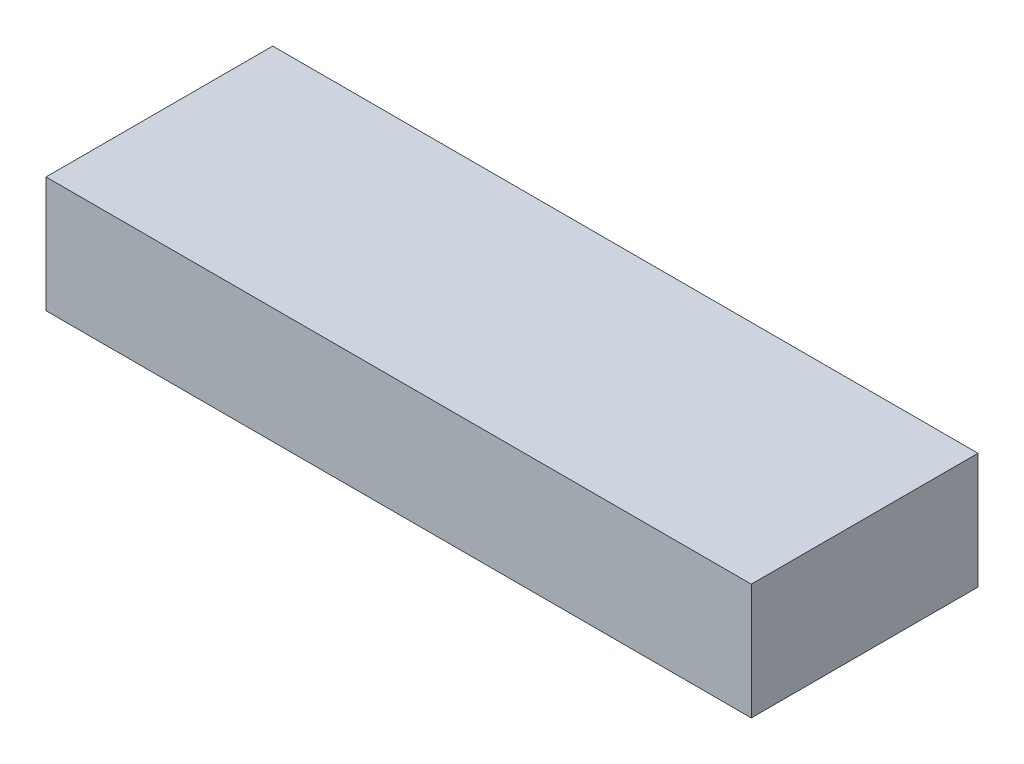
ISO-10303-21;
HEADER;
FILE_DESCRIPTION(('STEP AP214'),'2;1');
FILE_NAME('part.step','',(''),(''),'','','');
FILE_SCHEMA(('AUTOMOTIVE_DESIGN { 1 0 10303 214 1 1 1 1 }'));
ENDSEC;
DATA;
#1=APPLICATION_CONTEXT('core data for automotive mechanical design processes');
#2=APPLICATION_PROTOCOL_DEFINITION('international standard','automotive_design',2000,#1);
#3=PRODUCT_CONTEXT('',#1,'mechanical');
#4=PRODUCT('Part','Part','',(#3));
#5=PRODUCT_RELATED_PRODUCT_CATEGORY('part','',(#4));
#6=PRODUCT_DEFINITION_FORMATION('','',#4);
#7=PRODUCT_DEFINITION_CONTEXT('part definition',#1,'design');
#8=PRODUCT_DEFINITION('design','',#6,#7);
#9=PRODUCT_DEFINITION_SHAPE('','',#8);
#10=(LENGTH_UNIT() NAMED_UNIT(*) SI_UNIT(.MILLI.,.METRE.));
#11=(NAMED_UNIT(*) PLANE_ANGLE_UNIT() SI_UNIT($,.RADIAN.));
#12=(NAMED_UNIT(*) SI_UNIT($,.STERADIAN.) SOLID_ANGLE_UNIT());
#13=UNCERTAINTY_MEASURE_WITH_UNIT(LENGTH_MEASURE(1.E-05),#10,'distance_accuracy_value','');
#14=(GEOMETRIC_REPRESENTATION_CONTEXT(3) GLOBAL_UNCERTAINTY_ASSIGNED_CONTEXT((#13)) GLOBAL_UNIT_ASSIGNED_CONTEXT((#10,
#11,#12)) REPRESENTATION_CONTEXT('',''));
#15=CARTESIAN_POINT('',(0.,0.,0.));
#16=DIRECTION('',(0.,0.,1.));
#17=DIRECTION('',(1.,0.,0.));
#18=AXIS2_PLACEMENT_3D('',#15,#16,#17);
#19=CARTESIAN_POINT('',(-70.,23.,-22.5));
#20=DIRECTION('',(1.,0.,0.));
#21=DIRECTION('',(0.,0.,-1.));
#22=AXIS2_PLACEMENT_3D('',#19,#20,#21);
#23=PLANE('',#22);
#24=DIRECTION('',(0.,0.,1.));
#25=VECTOR('',#24,1.);
#26=CARTESIAN_POINT('',(-70.,0.,-22.5));
#27=LINE('',#26,#25);
#28=CARTESIAN_POINT('',(-70.,0.,-22.5));
#29=VERTEX_POINT('',#28);
#30=CARTESIAN_POINT('',(-70.,0.,22.5));
#31=VERTEX_POINT('',#30);
#32=EDGE_CURVE('E111',#29,#31,#27,.T.);
#33=ORIENTED_EDGE('',*,*,#32,.T.);
#34=DIRECTION('',(0.,-1.,0.));
#35=VECTOR('',#34,1.);
#36=CARTESIAN_POINT('',(-70.,23.,22.5));
#37=LINE('',#36,#35);
#38=CARTESIAN_POINT('',(-70.,23.,22.5));
#39=VERTEX_POINT('',#38);
#40=EDGE_CURVE('E11',#39,#31,#37,.T.);
#41=ORIENTED_EDGE('',*,*,#40,.F.);
#42=DIRECTION('',(0.,0.,1.));
#43=VECTOR('',#42,1.);
#44=CARTESIAN_POINT('',(-70.,23.,-22.5));
#45=LINE('',#44,#43);
#46=CARTESIAN_POINT('',(-70.,23.,-22.5));
#47=VERTEX_POINT('',#46);
#48=EDGE_CURVE('E95',#47,#39,#45,.T.);
#49=ORIENTED_EDGE('',*,*,#48,.F.);
#50=DIRECTION('',(0.,-1.,0.));
#51=VECTOR('',#50,1.);
#52=CARTESIAN_POINT('',(-70.,23.,-22.5));
#53=LINE('',#52,#51);
#54=EDGE_CURVE('E107',#47,#29,#53,.T.);
#55=ORIENTED_EDGE('',*,*,#54,.T.);
#56=EDGE_LOOP('',(#33,#41,#49,#55));
#57=FACE_BOUND('',#56,.T.);
#58=ADVANCED_FACE('F43',(#57),#23,.F.);
#59=CARTESIAN_POINT('',(70.,23.,22.5));
#60=DIRECTION('',(0.,0.,-1.));
#61=DIRECTION('',(-1.,0.,0.));
#62=AXIS2_PLACEMENT_3D('',#59,#60,#61);
#63=PLANE('',#62);
#64=DIRECTION('',(1.,0.,0.));
#65=VECTOR('',#64,1.);
#66=CARTESIAN_POINT('',(70.,0.,22.5));
#67=LINE('',#66,#65);
#68=CARTESIAN_POINT('',(70.,0.,22.5));
#69=VERTEX_POINT('',#68);
#70=EDGE_CURVE('E100',#31,#69,#67,.T.);
#71=ORIENTED_EDGE('',*,*,#70,.T.);
#72=DIRECTION('',(0.,-1.,0.));
#73=VECTOR('',#72,1.);
#74=CARTESIAN_POINT('',(70.,23.,22.5));
#75=LINE('',#74,#73);
#76=CARTESIAN_POINT('',(70.,23.,22.5));
#77=VERTEX_POINT('',#76);
#78=EDGE_CURVE('E52',#77,#69,#75,.T.);
#79=ORIENTED_EDGE('',*,*,#78,.F.);
#80=DIRECTION('',(1.,0.,0.));
#81=VECTOR('',#80,1.);
#82=CARTESIAN_POINT('',(70.,23.,22.5));
#83=LINE('',#82,#81);
#84=EDGE_CURVE('E90',#39,#77,#83,.T.);
#85=ORIENTED_EDGE('',*,*,#84,.F.);
#86=ORIENTED_EDGE('',*,*,#40,.T.);
#87=EDGE_LOOP('',(#71,#79,#85,#86));
#88=FACE_BOUND('',#87,.T.);
#89=ADVANCED_FACE('F99',(#88),#63,.F.);
#90=CARTESIAN_POINT('',(70.,23.,-22.5));
#91=DIRECTION('',(-1.,0.,0.));
#92=DIRECTION('',(0.,0.,1.));
#93=AXIS2_PLACEMENT_3D('',#90,#91,#92);
#94=PLANE('',#93);
#95=DIRECTION('',(0.,0.,-1.));
#96=VECTOR('',#95,1.);
#97=CARTESIAN_POINT('',(70.,0.,-22.5));
#98=LINE('',#97,#96);
#99=CARTESIAN_POINT('',(70.,0.,-22.5));
#100=VERTEX_POINT('',#99);
#101=EDGE_CURVE('E77',#69,#100,#98,.T.);
#102=ORIENTED_EDGE('',*,*,#101,.T.);
#103=DIRECTION('',(0.,-1.,0.));
#104=VECTOR('',#103,1.);
#105=CARTESIAN_POINT('',(70.,23.,-22.5));
#106=LINE('',#105,#104);
#107=CARTESIAN_POINT('',(70.,23.,-22.5));
#108=VERTEX_POINT('',#107);
#109=EDGE_CURVE('E102',#108,#100,#106,.T.);
#110=ORIENTED_EDGE('',*,*,#109,.F.);
#111=DIRECTION('',(0.,0.,-1.));
#112=VECTOR('',#111,1.);
#113=CARTESIAN_POINT('',(70.,23.,-22.5));
#114=LINE('',#113,#112);
#115=EDGE_CURVE('E93',#77,#108,#114,.T.);
#116=ORIENTED_EDGE('',*,*,#115,.F.);
#117=ORIENTED_EDGE('',*,*,#78,.T.);
#118=EDGE_LOOP('',(#102,#110,#116,#117));
#119=FACE_BOUND('',#118,.T.);
#120=ADVANCED_FACE('F103',(#119),#94,.F.);
#121=CARTESIAN_POINT('',(70.,23.,-22.5));
#122=DIRECTION('',(0.,0.,1.));
#123=DIRECTION('',(1.,0.,0.));
#124=AXIS2_PLACEMENT_3D('',#121,#122,#123);
#125=PLANE('',#124);
#126=DIRECTION('',(-1.,0.,0.));
#127=VECTOR('',#126,1.);
#128=CARTESIAN_POINT('',(70.,0.,-22.5));
#129=LINE('',#128,#127);
#130=EDGE_CURVE('E83',#100,#29,#129,.T.);
#131=ORIENTED_EDGE('',*,*,#130,.T.);
#132=ORIENTED_EDGE('',*,*,#54,.F.);
#133=DIRECTION('',(-1.,0.,0.));
#134=VECTOR('',#133,1.);
#135=CARTESIAN_POINT('',(70.,23.,-22.5));
#136=LINE('',#135,#134);
#137=EDGE_CURVE('E60',#108,#47,#136,.T.);
#138=ORIENTED_EDGE('',*,*,#137,.F.);
#139=ORIENTED_EDGE('',*,*,#109,.T.);
#140=EDGE_LOOP('',(#131,#132,#138,#139));
#141=FACE_BOUND('',#140,.T.);
#142=ADVANCED_FACE('F124',(#141),#125,.F.);
#143=CARTESIAN_POINT('',(0.,23.,0.));
#144=DIRECTION('',(0.,-1.,0.));
#145=DIRECTION('',(0.,0.,-1.));
#146=AXIS2_PLACEMENT_3D('',#143,#144,#145);
#147=PLANE('',#146);
#148=ORIENTED_EDGE('',*,*,#48,.T.);
#149=ORIENTED_EDGE('',*,*,#84,.T.);
#150=ORIENTED_EDGE('',*,*,#115,.T.);
#151=ORIENTED_EDGE('',*,*,#137,.T.);
#152=EDGE_LOOP('',(#148,#149,#150,#151));
#153=FACE_BOUND('',#152,.T.);
#154=ADVANCED_FACE('F91',(#153),#147,.F.);
#155=CARTESIAN_POINT('',(0.,0.,0.));
#156=DIRECTION('',(0.,-1.,0.));
#157=DIRECTION('',(0.,0.,-1.));
#158=AXIS2_PLACEMENT_3D('',#155,#156,#157);
#159=PLANE('',#158);
#160=ORIENTED_EDGE('',*,*,#32,.F.);
#161=ORIENTED_EDGE('',*,*,#130,.F.);
#162=ORIENTED_EDGE('',*,*,#101,.F.);
#163=ORIENTED_EDGE('',*,*,#70,.F.);
#164=EDGE_LOOP('',(#160,#161,#162,#163));
#165=FACE_BOUND('',#164,.T.);
#166=ADVANCED_FACE('F127',(#165),#159,.T.);
#167=CLOSED_SHELL('',(#58,#89,#120,#142,#154,#166));
#168=MANIFOLD_SOLID_BREP('B2',#167);
#169=ADVANCED_BREP_SHAPE_REPRESENTATION('',(#18,#168),#14);
#170=SHAPE_DEFINITION_REPRESENTATION(#9,#169);
ENDSEC;
END-ISO-10303-21;
